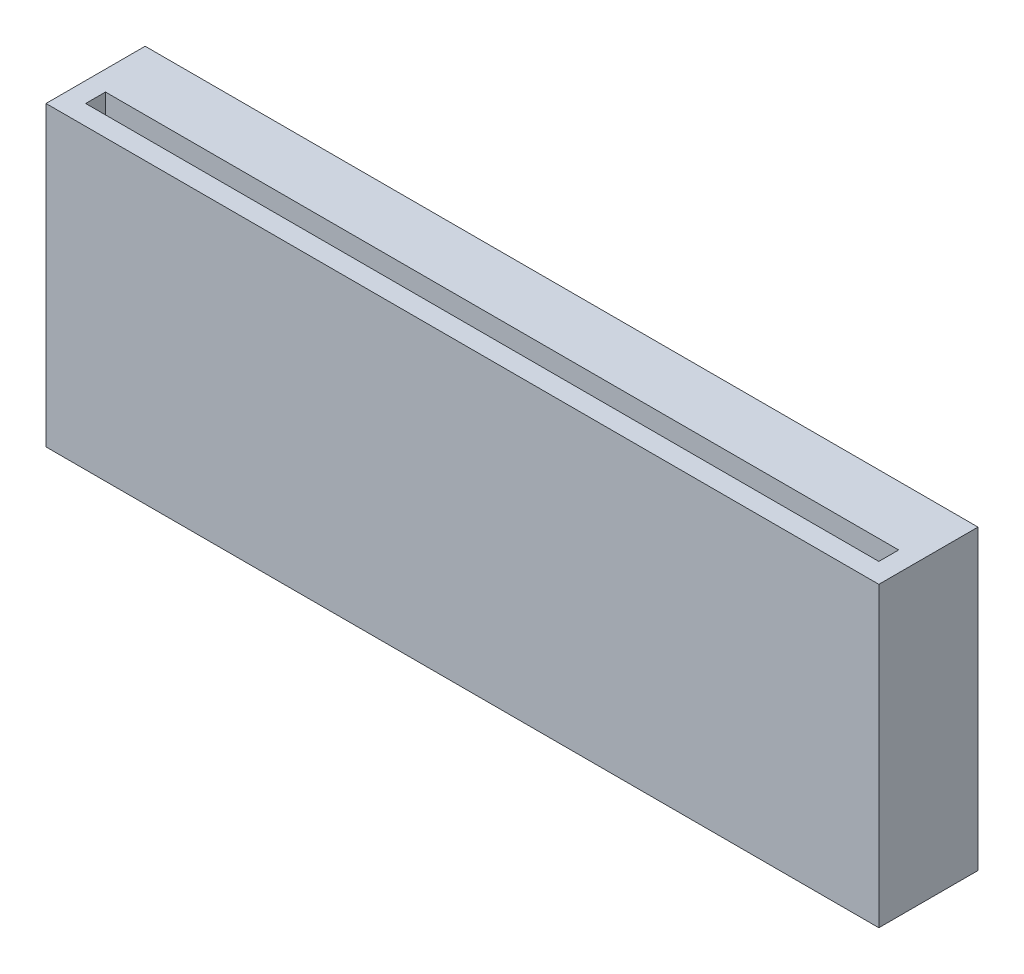
ISO-10303-21;
HEADER;
FILE_DESCRIPTION(('STEP AP214'),'2;1');
FILE_NAME('part.step','',(''),(''),'','','');
FILE_SCHEMA(('AUTOMOTIVE_DESIGN { 1 0 10303 214 1 1 1 1 }'));
ENDSEC;
DATA;
#1=APPLICATION_CONTEXT('core data for automotive mechanical design processes');
#2=APPLICATION_PROTOCOL_DEFINITION('international standard','automotive_design',2000,#1);
#3=PRODUCT_CONTEXT('',#1,'mechanical');
#4=PRODUCT('Part','Part','',(#3));
#5=PRODUCT_RELATED_PRODUCT_CATEGORY('part','',(#4));
#6=PRODUCT_DEFINITION_FORMATION('','',#4);
#7=PRODUCT_DEFINITION_CONTEXT('part definition',#1,'design');
#8=PRODUCT_DEFINITION('design','',#6,#7);
#9=PRODUCT_DEFINITION_SHAPE('','',#8);
#10=(LENGTH_UNIT() NAMED_UNIT(*) SI_UNIT(.MILLI.,.METRE.));
#11=(NAMED_UNIT(*) PLANE_ANGLE_UNIT() SI_UNIT($,.RADIAN.));
#12=(NAMED_UNIT(*) SI_UNIT($,.STERADIAN.) SOLID_ANGLE_UNIT());
#13=UNCERTAINTY_MEASURE_WITH_UNIT(LENGTH_MEASURE(1.E-05),#10,'distance_accuracy_value','');
#14=(GEOMETRIC_REPRESENTATION_CONTEXT(3) GLOBAL_UNCERTAINTY_ASSIGNED_CONTEXT((#13)) GLOBAL_UNIT_ASSIGNED_CONTEXT((#10,
#11,#12)) REPRESENTATION_CONTEXT('',''));
#15=CARTESIAN_POINT('',(0.,0.,0.));
#16=DIRECTION('',(0.,0.,1.));
#17=DIRECTION('',(1.,0.,0.));
#18=AXIS2_PLACEMENT_3D('',#15,#16,#17);
#19=CARTESIAN_POINT('',(0.,0.,0.));
#20=DIRECTION('',(0.,0.,1.));
#21=DIRECTION('',(1.,0.,0.));
#22=AXIS2_PLACEMENT_3D('',#19,#20,#21);
#23=PLANE('',#22);
#24=DIRECTION('',(0.,-1.,0.));
#25=VECTOR('',#24,1.);
#26=CARTESIAN_POINT('',(-32.,7.5,0.));
#27=LINE('',#26,#25);
#28=CARTESIAN_POINT('',(-32.,7.5,0.));
#29=VERTEX_POINT('',#28);
#30=CARTESIAN_POINT('',(-32.,0.,0.));
#31=VERTEX_POINT('',#30);
#32=EDGE_CURVE('E365',#29,#31,#27,.T.);
#33=ORIENTED_EDGE('',*,*,#32,.T.);
#34=DIRECTION('',(1.,0.,0.));
#35=VECTOR('',#34,1.);
#36=CARTESIAN_POINT('',(0.,0.,0.));
#37=LINE('',#36,#35);
#38=CARTESIAN_POINT('',(-41.,0.,0.));
#39=VERTEX_POINT('',#38);
#40=EDGE_CURVE('E43',#39,#31,#37,.T.);
#41=ORIENTED_EDGE('',*,*,#40,.F.);
#42=DIRECTION('',(0.,1.,0.));
#43=VECTOR('',#42,1.);
#44=CARTESIAN_POINT('',(-41.,0.,0.));
#45=LINE('',#44,#43);
#46=CARTESIAN_POINT('',(-41.,15.,0.));
#47=VERTEX_POINT('',#46);
#48=EDGE_CURVE('E271',#39,#47,#45,.T.);
#49=ORIENTED_EDGE('',*,*,#48,.T.);
#50=DIRECTION('',(-1.,0.,0.));
#51=VECTOR('',#50,1.);
#52=CARTESIAN_POINT('',(0.,15.,0.));
#53=LINE('',#52,#51);
#54=CARTESIAN_POINT('',(1.,15.,0.));
#55=VERTEX_POINT('',#54);
#56=EDGE_CURVE('E483',#55,#47,#53,.T.);
#57=ORIENTED_EDGE('',*,*,#56,.F.);
#58=DIRECTION('',(0.,1.,0.));
#59=VECTOR('',#58,1.);
#60=CARTESIAN_POINT('',(1.,0.,0.));
#61=LINE('',#60,#59);
#62=CARTESIAN_POINT('',(1.,0.,0.));
#63=VERTEX_POINT('',#62);
#64=EDGE_CURVE('E292',#63,#55,#61,.T.);
#65=ORIENTED_EDGE('',*,*,#64,.F.);
#66=CARTESIAN_POINT('',(-8.,0.,0.));
#67=VERTEX_POINT('',#66);
#68=EDGE_CURVE('E513',#67,#63,#37,.T.);
#69=ORIENTED_EDGE('',*,*,#68,.F.);
#70=DIRECTION('',(0.,-1.,0.));
#71=VECTOR('',#70,1.);
#72=CARTESIAN_POINT('',(-8.,7.5,0.));
#73=LINE('',#72,#71);
#74=CARTESIAN_POINT('',(-8.,7.5,0.));
#75=VERTEX_POINT('',#74);
#76=EDGE_CURVE('E445',#75,#67,#73,.T.);
#77=ORIENTED_EDGE('',*,*,#76,.F.);
#78=DIRECTION('',(-1.,0.,0.));
#79=VECTOR('',#78,1.);
#80=CARTESIAN_POINT('',(-8.,7.5,0.));
#81=LINE('',#80,#79);
#82=CARTESIAN_POINT('',(-12.,7.5,0.));
#83=VERTEX_POINT('',#82);
#84=EDGE_CURVE('E408',#75,#83,#81,.T.);
#85=ORIENTED_EDGE('',*,*,#84,.T.);
#86=DIRECTION('',(0.,-1.,0.));
#87=VECTOR('',#86,1.);
#88=CARTESIAN_POINT('',(-12.,7.5,0.));
#89=LINE('',#88,#87);
#90=CARTESIAN_POINT('',(-12.,0.,0.));
#91=VERTEX_POINT('',#90);
#92=EDGE_CURVE('E505',#83,#91,#89,.T.);
#93=ORIENTED_EDGE('',*,*,#92,.T.);
#94=CARTESIAN_POINT('',(-28.,0.,0.));
#95=VERTEX_POINT('',#94);
#96=EDGE_CURVE('E517',#95,#91,#37,.T.);
#97=ORIENTED_EDGE('',*,*,#96,.F.);
#98=DIRECTION('',(0.,-1.,0.));
#99=VECTOR('',#98,1.);
#100=CARTESIAN_POINT('',(-28.,7.5,0.));
#101=LINE('',#100,#99);
#102=CARTESIAN_POINT('',(-28.,7.5,0.));
#103=VERTEX_POINT('',#102);
#104=EDGE_CURVE('E370',#103,#95,#101,.T.);
#105=ORIENTED_EDGE('',*,*,#104,.F.);
#106=DIRECTION('',(1.,0.,0.));
#107=VECTOR('',#106,1.);
#108=CARTESIAN_POINT('',(-32.,7.5,0.));
#109=LINE('',#108,#107);
#110=EDGE_CURVE('E336',#29,#103,#109,.T.);
#111=ORIENTED_EDGE('',*,*,#110,.F.);
#112=EDGE_LOOP('',(#33,#41,#49,#57,#65,#69,#77,#85,#93,#97,#105,#111));
#113=FACE_BOUND('',#112,.T.);
#114=ADVANCED_FACE('F39',(#113),#23,.F.);
#115=CARTESIAN_POINT('',(0.,15.,5.));
#116=DIRECTION('',(0.,-1.,0.));
#117=DIRECTION('',(1.,0.,0.));
#118=AXIS2_PLACEMENT_3D('',#115,#116,#117);
#119=PLANE('',#118);
#120=DIRECTION('',(-1.,0.,0.));
#121=VECTOR('',#120,1.);
#122=CARTESIAN_POINT('',(0.,15.,3.));
#123=LINE('',#122,#121);
#124=CARTESIAN_POINT('',(0.,15.,3.));
#125=VERTEX_POINT('',#124);
#126=CARTESIAN_POINT('',(-40.,15.,3.00000000000001));
#127=VERTEX_POINT('',#126);
#128=EDGE_CURVE('E262',#125,#127,#123,.T.);
#129=ORIENTED_EDGE('',*,*,#128,.F.);
#130=DIRECTION('',(0.,0.,-1.));
#131=VECTOR('',#130,1.);
#132=CARTESIAN_POINT('',(0.,15.,3.));
#133=LINE('',#132,#131);
#134=CARTESIAN_POINT('',(0.,15.,4.));
#135=VERTEX_POINT('',#134);
#136=EDGE_CURVE('E57',#135,#125,#133,.T.);
#137=ORIENTED_EDGE('',*,*,#136,.F.);
#138=DIRECTION('',(1.,0.,0.));
#139=VECTOR('',#138,1.);
#140=CARTESIAN_POINT('',(0.,15.,4.));
#141=LINE('',#140,#139);
#142=CARTESIAN_POINT('',(-40.,15.,4.00000000000001));
#143=VERTEX_POINT('',#142);
#144=EDGE_CURVE('E249',#143,#135,#141,.T.);
#145=ORIENTED_EDGE('',*,*,#144,.F.);
#146=DIRECTION('',(0.,0.,1.));
#147=VECTOR('',#146,1.);
#148=CARTESIAN_POINT('',(-40.,15.,3.00000000000001));
#149=LINE('',#148,#147);
#150=EDGE_CURVE('E253',#127,#143,#149,.T.);
#151=ORIENTED_EDGE('',*,*,#150,.F.);
#152=EDGE_LOOP('',(#129,#137,#145,#151));
#153=FACE_BOUND('',#152,.T.);
#154=ORIENTED_EDGE('',*,*,#56,.T.);
#155=DIRECTION('',(0.,0.,1.));
#156=VECTOR('',#155,1.);
#157=CARTESIAN_POINT('',(-41.,15.,0.));
#158=LINE('',#157,#156);
#159=CARTESIAN_POINT('',(-41.,15.,5.));
#160=VERTEX_POINT('',#159);
#161=EDGE_CURVE('E288',#47,#160,#158,.T.);
#162=ORIENTED_EDGE('',*,*,#161,.T.);
#163=DIRECTION('',(-1.,0.,0.));
#164=VECTOR('',#163,1.);
#165=CARTESIAN_POINT('',(0.,15.,5.));
#166=LINE('',#165,#164);
#167=CARTESIAN_POINT('',(1.,15.,5.));
#168=VERTEX_POINT('',#167);
#169=EDGE_CURVE('E49',#168,#160,#166,.T.);
#170=ORIENTED_EDGE('',*,*,#169,.F.);
#171=DIRECTION('',(0.,0.,1.));
#172=VECTOR('',#171,1.);
#173=CARTESIAN_POINT('',(1.,15.,0.));
#174=LINE('',#173,#172);
#175=EDGE_CURVE('E296',#55,#168,#174,.T.);
#176=ORIENTED_EDGE('',*,*,#175,.F.);
#177=EDGE_LOOP('',(#154,#162,#170,#176));
#178=FACE_BOUND('',#177,.T.);
#179=ADVANCED_FACE('F41',(#153,#178),#119,.F.);
#180=CARTESIAN_POINT('',(0.,0.,5.));
#181=DIRECTION('',(0.,1.,0.));
#182=DIRECTION('',(0.,0.,1.));
#183=AXIS2_PLACEMENT_3D('',#180,#181,#182);
#184=PLANE('',#183);
#185=ORIENTED_EDGE('',*,*,#40,.T.);
#186=DIRECTION('',(0.,0.,1.));
#187=VECTOR('',#186,1.);
#188=CARTESIAN_POINT('',(-32.,0.,0.));
#189=LINE('',#188,#187);
#190=CARTESIAN_POINT('',(-32.,0.,-2.49999999999999));
#191=VERTEX_POINT('',#190);
#192=EDGE_CURVE('E308',#191,#31,#189,.T.);
#193=ORIENTED_EDGE('',*,*,#192,.F.);
#194=DIRECTION('',(1.,0.,0.));
#195=VECTOR('',#194,1.);
#196=CARTESIAN_POINT('',(-32.,0.,-2.49999999999999));
#197=LINE('',#196,#195);
#198=CARTESIAN_POINT('',(-34.5,0.,-2.5));
#199=VERTEX_POINT('',#198);
#200=EDGE_CURVE('E342',#199,#191,#197,.T.);
#201=ORIENTED_EDGE('',*,*,#200,.F.);
#202=DIRECTION('',(0.,0.,1.));
#203=VECTOR('',#202,1.);
#204=CARTESIAN_POINT('',(-34.5,0.,-2.5));
#205=LINE('',#204,#203);
#206=CARTESIAN_POINT('',(-34.5,0.,-3.5));
#207=VERTEX_POINT('',#206);
#208=EDGE_CURVE('E345',#207,#199,#205,.T.);
#209=ORIENTED_EDGE('',*,*,#208,.F.);
#210=DIRECTION('',(-0.707106781186547,0.,0.707106781186548));
#211=VECTOR('',#210,1.);
#212=CARTESIAN_POINT('',(-34.5,0.,-3.5));
#213=LINE('',#212,#211);
#214=CARTESIAN_POINT('',(-32.,0.,-6.));
#215=VERTEX_POINT('',#214);
#216=EDGE_CURVE('E348',#215,#207,#213,.T.);
#217=ORIENTED_EDGE('',*,*,#216,.F.);
#218=DIRECTION('',(-1.,0.,0.));
#219=VECTOR('',#218,1.);
#220=CARTESIAN_POINT('',(-32.,0.,-6.));
#221=LINE('',#220,#219);
#222=CARTESIAN_POINT('',(-28.,0.,-6.));
#223=VERTEX_POINT('',#222);
#224=EDGE_CURVE('E351',#223,#215,#221,.T.);
#225=ORIENTED_EDGE('',*,*,#224,.F.);
#226=DIRECTION('',(-0.707106781186548,0.,-0.707106781186547));
#227=VECTOR('',#226,1.);
#228=CARTESIAN_POINT('',(-28.,0.,-6.));
#229=LINE('',#228,#227);
#230=CARTESIAN_POINT('',(-25.5,0.,-3.5));
#231=VERTEX_POINT('',#230);
#232=EDGE_CURVE('E354',#231,#223,#229,.T.);
#233=ORIENTED_EDGE('',*,*,#232,.F.);
#234=DIRECTION('',(0.,0.,-1.));
#235=VECTOR('',#234,1.);
#236=CARTESIAN_POINT('',(-25.5,0.,-3.5));
#237=LINE('',#236,#235);
#238=CARTESIAN_POINT('',(-25.5,0.,-2.5));
#239=VERTEX_POINT('',#238);
#240=EDGE_CURVE('E357',#239,#231,#237,.T.);
#241=ORIENTED_EDGE('',*,*,#240,.F.);
#242=DIRECTION('',(1.,0.,0.));
#243=VECTOR('',#242,1.);
#244=CARTESIAN_POINT('',(-25.5,0.,-2.5));
#245=LINE('',#244,#243);
#246=CARTESIAN_POINT('',(-28.,0.,-2.49999999999999));
#247=VERTEX_POINT('',#246);
#248=EDGE_CURVE('E360',#247,#239,#245,.T.);
#249=ORIENTED_EDGE('',*,*,#248,.F.);
#250=DIRECTION('',(0.,0.,-1.));
#251=VECTOR('',#250,1.);
#252=CARTESIAN_POINT('',(-28.,0.,0.));
#253=LINE('',#252,#251);
#254=EDGE_CURVE('E65',#95,#247,#253,.T.);
#255=ORIENTED_EDGE('',*,*,#254,.F.);
#256=ORIENTED_EDGE('',*,*,#96,.T.);
#257=DIRECTION('',(0.,0.,-1.));
#258=VECTOR('',#257,1.);
#259=CARTESIAN_POINT('',(-12.,0.,0.));
#260=LINE('',#259,#258);
#261=CARTESIAN_POINT('',(-12.,0.,-2.49999999999999));
#262=VERTEX_POINT('',#261);
#263=EDGE_CURVE('E449',#91,#262,#260,.T.);
#264=ORIENTED_EDGE('',*,*,#263,.T.);
#265=DIRECTION('',(-1.,0.,0.));
#266=VECTOR('',#265,1.);
#267=CARTESIAN_POINT('',(-14.5,0.,-2.5));
#268=LINE('',#267,#266);
#269=CARTESIAN_POINT('',(-14.5,0.,-2.5));
#270=VERTEX_POINT('',#269);
#271=EDGE_CURVE('E453',#262,#270,#268,.T.);
#272=ORIENTED_EDGE('',*,*,#271,.T.);
#273=DIRECTION('',(0.,0.,-1.));
#274=VECTOR('',#273,1.);
#275=CARTESIAN_POINT('',(-14.5,0.,-3.5));
#276=LINE('',#275,#274);
#277=CARTESIAN_POINT('',(-14.5,0.,-3.5));
#278=VERTEX_POINT('',#277);
#279=EDGE_CURVE('E457',#270,#278,#276,.T.);
#280=ORIENTED_EDGE('',*,*,#279,.T.);
#281=DIRECTION('',(0.707106781186548,0.,-0.707106781186547));
#282=VECTOR('',#281,1.);
#283=CARTESIAN_POINT('',(-12.,0.,-6.));
#284=LINE('',#283,#282);
#285=CARTESIAN_POINT('',(-12.,0.,-6.));
#286=VERTEX_POINT('',#285);
#287=EDGE_CURVE('E461',#278,#286,#284,.T.);
#288=ORIENTED_EDGE('',*,*,#287,.T.);
#289=DIRECTION('',(1.,0.,0.));
#290=VECTOR('',#289,1.);
#291=CARTESIAN_POINT('',(-8.,0.,-6.));
#292=LINE('',#291,#290);
#293=CARTESIAN_POINT('',(-8.,0.,-6.));
#294=VERTEX_POINT('',#293);
#295=EDGE_CURVE('E465',#286,#294,#292,.T.);
#296=ORIENTED_EDGE('',*,*,#295,.T.);
#297=DIRECTION('',(0.707106781186547,0.,0.707106781186548));
#298=VECTOR('',#297,1.);
#299=CARTESIAN_POINT('',(-5.5,0.,-3.5));
#300=LINE('',#299,#298);
#301=CARTESIAN_POINT('',(-5.5,0.,-3.5));
#302=VERTEX_POINT('',#301);
#303=EDGE_CURVE('E469',#294,#302,#300,.T.);
#304=ORIENTED_EDGE('',*,*,#303,.T.);
#305=DIRECTION('',(0.,0.,1.));
#306=VECTOR('',#305,1.);
#307=CARTESIAN_POINT('',(-5.5,0.,-2.5));
#308=LINE('',#307,#306);
#309=CARTESIAN_POINT('',(-5.5,0.,-2.5));
#310=VERTEX_POINT('',#309);
#311=EDGE_CURVE('E473',#302,#310,#308,.T.);
#312=ORIENTED_EDGE('',*,*,#311,.T.);
#313=DIRECTION('',(-1.,0.,0.));
#314=VECTOR('',#313,1.);
#315=CARTESIAN_POINT('',(-8.,0.,-2.49999999999999));
#316=LINE('',#315,#314);
#317=CARTESIAN_POINT('',(-8.,0.,-2.49999999999999));
#318=VERTEX_POINT('',#317);
#319=EDGE_CURVE('E409',#310,#318,#316,.T.);
#320=ORIENTED_EDGE('',*,*,#319,.T.);
#321=DIRECTION('',(0.,0.,1.));
#322=VECTOR('',#321,1.);
#323=CARTESIAN_POINT('',(-8.,0.,0.));
#324=LINE('',#323,#322);
#325=EDGE_CURVE('E369',#318,#67,#324,.T.);
#326=ORIENTED_EDGE('',*,*,#325,.T.);
#327=ORIENTED_EDGE('',*,*,#68,.T.);
#328=DIRECTION('',(0.,0.,-1.));
#329=VECTOR('',#328,1.);
#330=CARTESIAN_POINT('',(1.,0.,0.));
#331=LINE('',#330,#329);
#332=CARTESIAN_POINT('',(1.,0.,5.));
#333=VERTEX_POINT('',#332);
#334=EDGE_CURVE('E304',#333,#63,#331,.T.);
#335=ORIENTED_EDGE('',*,*,#334,.F.);
#336=DIRECTION('',(1.,0.,0.));
#337=VECTOR('',#336,1.);
#338=CARTESIAN_POINT('',(0.,0.,5.));
#339=LINE('',#338,#337);
#340=CARTESIAN_POINT('',(-41.,0.,5.));
#341=VERTEX_POINT('',#340);
#342=EDGE_CURVE('E11',#341,#333,#339,.T.);
#343=ORIENTED_EDGE('',*,*,#342,.F.);
#344=DIRECTION('',(0.,0.,-1.));
#345=VECTOR('',#344,1.);
#346=CARTESIAN_POINT('',(-41.,0.,0.));
#347=LINE('',#346,#345);
#348=EDGE_CURVE('E280',#341,#39,#347,.T.);
#349=ORIENTED_EDGE('',*,*,#348,.T.);
#350=EDGE_LOOP('',(#185,#193,#201,#209,#217,#225,#233,#241,#249,#255,#256,#264,#272,#280,#288,
#296,#304,#312,#320,#326,#327,#335,#343,#349));
#351=FACE_BOUND('',#350,.T.);
#352=ADVANCED_FACE('F524',(#351),#184,.F.);
#353=CARTESIAN_POINT('',(0.,0.,5.));
#354=DIRECTION('',(0.,0.,1.));
#355=DIRECTION('',(1.,0.,0.));
#356=AXIS2_PLACEMENT_3D('',#353,#354,#355);
#357=PLANE('',#356);
#358=ORIENTED_EDGE('',*,*,#342,.T.);
#359=DIRECTION('',(0.,-1.,0.));
#360=VECTOR('',#359,1.);
#361=CARTESIAN_POINT('',(1.,0.,5.));
#362=LINE('',#361,#360);
#363=EDGE_CURVE('E300',#168,#333,#362,.T.);
#364=ORIENTED_EDGE('',*,*,#363,.F.);
#365=ORIENTED_EDGE('',*,*,#169,.T.);
#366=DIRECTION('',(0.,-1.,0.));
#367=VECTOR('',#366,1.);
#368=CARTESIAN_POINT('',(-41.,0.,5.));
#369=LINE('',#368,#367);
#370=EDGE_CURVE('E284',#160,#341,#369,.T.);
#371=ORIENTED_EDGE('',*,*,#370,.T.);
#372=EDGE_LOOP('',(#358,#364,#365,#371));
#373=FACE_BOUND('',#372,.T.);
#374=ADVANCED_FACE('F540',(#373),#357,.T.);
#375=CARTESIAN_POINT('',(-8.,7.5,0.));
#376=DIRECTION('',(1.,0.,0.));
#377=DIRECTION('',(0.,0.,-1.));
#378=AXIS2_PLACEMENT_3D('',#375,#376,#377);
#379=PLANE('',#378);
#380=ORIENTED_EDGE('',*,*,#325,.F.);
#381=DIRECTION('',(0.,-1.,0.));
#382=VECTOR('',#381,1.);
#383=CARTESIAN_POINT('',(-8.,7.5,-2.49999999999999));
#384=LINE('',#383,#382);
#385=CARTESIAN_POINT('',(-8.,7.5,-2.49999999999999));
#386=VERTEX_POINT('',#385);
#387=EDGE_CURVE('E480',#386,#318,#384,.T.);
#388=ORIENTED_EDGE('',*,*,#387,.F.);
#389=DIRECTION('',(0.,0.,1.));
#390=VECTOR('',#389,1.);
#391=CARTESIAN_POINT('',(-8.,7.5,0.));
#392=LINE('',#391,#390);
#393=EDGE_CURVE('E404',#386,#75,#392,.T.);
#394=ORIENTED_EDGE('',*,*,#393,.T.);
#395=ORIENTED_EDGE('',*,*,#76,.T.);
#396=EDGE_LOOP('',(#380,#388,#394,#395));
#397=FACE_BOUND('',#396,.T.);
#398=ADVANCED_FACE('F544',(#397),#379,.T.);
#399=CARTESIAN_POINT('',(-8.,7.5,-2.49999999999999));
#400=DIRECTION('',(0.,0.,1.));
#401=DIRECTION('',(1.,0.,0.));
#402=AXIS2_PLACEMENT_3D('',#399,#400,#401);
#403=PLANE('',#402);
#404=ORIENTED_EDGE('',*,*,#319,.F.);
#405=DIRECTION('',(0.,-1.,0.));
#406=VECTOR('',#405,1.);
#407=CARTESIAN_POINT('',(-5.5,7.5,-2.5));
#408=LINE('',#407,#406);
#409=CARTESIAN_POINT('',(-5.5,7.5,-2.5));
#410=VERTEX_POINT('',#409);
#411=EDGE_CURVE('E484',#410,#310,#408,.T.);
#412=ORIENTED_EDGE('',*,*,#411,.F.);
#413=DIRECTION('',(-1.,0.,0.));
#414=VECTOR('',#413,1.);
#415=CARTESIAN_POINT('',(-8.,7.5,-2.49999999999999));
#416=LINE('',#415,#414);
#417=EDGE_CURVE('E441',#410,#386,#416,.T.);
#418=ORIENTED_EDGE('',*,*,#417,.T.);
#419=ORIENTED_EDGE('',*,*,#387,.T.);
#420=EDGE_LOOP('',(#404,#412,#418,#419));
#421=FACE_BOUND('',#420,.T.);
#422=ADVANCED_FACE('F549',(#421),#403,.T.);
#423=CARTESIAN_POINT('',(-5.5,7.5,-2.5));
#424=DIRECTION('',(1.,0.,0.));
#425=DIRECTION('',(0.,0.,-1.));
#426=AXIS2_PLACEMENT_3D('',#423,#424,#425);
#427=PLANE('',#426);
#428=ORIENTED_EDGE('',*,*,#311,.F.);
#429=DIRECTION('',(0.,-1.,0.));
#430=VECTOR('',#429,1.);
#431=CARTESIAN_POINT('',(-5.5,7.5,-3.5));
#432=LINE('',#431,#430);
#433=CARTESIAN_POINT('',(-5.5,7.5,-3.5));
#434=VERTEX_POINT('',#433);
#435=EDGE_CURVE('E487',#434,#302,#432,.T.);
#436=ORIENTED_EDGE('',*,*,#435,.F.);
#437=DIRECTION('',(0.,0.,1.));
#438=VECTOR('',#437,1.);
#439=CARTESIAN_POINT('',(-5.5,7.5,-2.5));
#440=LINE('',#439,#438);
#441=EDGE_CURVE('E437',#434,#410,#440,.T.);
#442=ORIENTED_EDGE('',*,*,#441,.T.);
#443=ORIENTED_EDGE('',*,*,#411,.T.);
#444=EDGE_LOOP('',(#428,#436,#442,#443));
#445=FACE_BOUND('',#444,.T.);
#446=ADVANCED_FACE('F581',(#445),#427,.T.);
#447=CARTESIAN_POINT('',(-5.5,7.5,-3.5));
#448=DIRECTION('',(0.707106781186548,0.,-0.707106781186547));
#449=DIRECTION('',(-0.707106781186547,0.,-0.707106781186548));
#450=AXIS2_PLACEMENT_3D('',#447,#448,#449);
#451=PLANE('',#450);
#452=ORIENTED_EDGE('',*,*,#303,.F.);
#453=DIRECTION('',(0.,-1.,0.));
#454=VECTOR('',#453,1.);
#455=CARTESIAN_POINT('',(-8.,7.5,-6.));
#456=LINE('',#455,#454);
#457=CARTESIAN_POINT('',(-8.,7.5,-6.));
#458=VERTEX_POINT('',#457);
#459=EDGE_CURVE('E490',#458,#294,#456,.T.);
#460=ORIENTED_EDGE('',*,*,#459,.F.);
#461=DIRECTION('',(0.707106781186547,0.,0.707106781186548));
#462=VECTOR('',#461,1.);
#463=CARTESIAN_POINT('',(-5.5,7.5,-3.5));
#464=LINE('',#463,#462);
#465=EDGE_CURVE('E433',#458,#434,#464,.T.);
#466=ORIENTED_EDGE('',*,*,#465,.T.);
#467=ORIENTED_EDGE('',*,*,#435,.T.);
#468=EDGE_LOOP('',(#452,#460,#466,#467));
#469=FACE_BOUND('',#468,.T.);
#470=ADVANCED_FACE('F579',(#469),#451,.T.);
#471=CARTESIAN_POINT('',(-8.,7.5,-6.));
#472=DIRECTION('',(0.,0.,-1.));
#473=DIRECTION('',(-1.,0.,0.));
#474=AXIS2_PLACEMENT_3D('',#471,#472,#473);
#475=PLANE('',#474);
#476=ORIENTED_EDGE('',*,*,#295,.F.);
#477=DIRECTION('',(0.,-1.,0.));
#478=VECTOR('',#477,1.);
#479=CARTESIAN_POINT('',(-12.,7.5,-6.));
#480=LINE('',#479,#478);
#481=CARTESIAN_POINT('',(-12.,7.5,-6.));
#482=VERTEX_POINT('',#481);
#483=EDGE_CURVE('E493',#482,#286,#480,.T.);
#484=ORIENTED_EDGE('',*,*,#483,.F.);
#485=DIRECTION('',(1.,0.,0.));
#486=VECTOR('',#485,1.);
#487=CARTESIAN_POINT('',(-8.,7.5,-6.));
#488=LINE('',#487,#486);
#489=EDGE_CURVE('E429',#482,#458,#488,.T.);
#490=ORIENTED_EDGE('',*,*,#489,.T.);
#491=ORIENTED_EDGE('',*,*,#459,.T.);
#492=EDGE_LOOP('',(#476,#484,#490,#491));
#493=FACE_BOUND('',#492,.T.);
#494=ADVANCED_FACE('F575',(#493),#475,.T.);
#495=CARTESIAN_POINT('',(-12.,7.5,-6.));
#496=DIRECTION('',(-0.707106781186547,0.,-0.707106781186548));
#497=DIRECTION('',(-0.707106781186548,0.,0.707106781186547));
#498=AXIS2_PLACEMENT_3D('',#495,#496,#497);
#499=PLANE('',#498);
#500=ORIENTED_EDGE('',*,*,#287,.F.);
#501=DIRECTION('',(0.,-1.,0.));
#502=VECTOR('',#501,1.);
#503=CARTESIAN_POINT('',(-14.5,7.5,-3.5));
#504=LINE('',#503,#502);
#505=CARTESIAN_POINT('',(-14.5,7.5,-3.5));
#506=VERTEX_POINT('',#505);
#507=EDGE_CURVE('E496',#506,#278,#504,.T.);
#508=ORIENTED_EDGE('',*,*,#507,.F.);
#509=DIRECTION('',(0.707106781186548,0.,-0.707106781186547));
#510=VECTOR('',#509,1.);
#511=CARTESIAN_POINT('',(-12.,7.5,-6.));
#512=LINE('',#511,#510);
#513=EDGE_CURVE('E425',#506,#482,#512,.T.);
#514=ORIENTED_EDGE('',*,*,#513,.T.);
#515=ORIENTED_EDGE('',*,*,#483,.T.);
#516=EDGE_LOOP('',(#500,#508,#514,#515));
#517=FACE_BOUND('',#516,.T.);
#518=ADVANCED_FACE('F571',(#517),#499,.T.);
#519=CARTESIAN_POINT('',(-14.5,7.5,-3.5));
#520=DIRECTION('',(-1.,0.,0.));
#521=DIRECTION('',(0.,0.,1.));
#522=AXIS2_PLACEMENT_3D('',#519,#520,#521);
#523=PLANE('',#522);
#524=ORIENTED_EDGE('',*,*,#279,.F.);
#525=DIRECTION('',(0.,-1.,0.));
#526=VECTOR('',#525,1.);
#527=CARTESIAN_POINT('',(-14.5,7.5,-2.5));
#528=LINE('',#527,#526);
#529=CARTESIAN_POINT('',(-14.5,7.5,-2.5));
#530=VERTEX_POINT('',#529);
#531=EDGE_CURVE('E499',#530,#270,#528,.T.);
#532=ORIENTED_EDGE('',*,*,#531,.F.);
#533=DIRECTION('',(0.,0.,-1.));
#534=VECTOR('',#533,1.);
#535=CARTESIAN_POINT('',(-14.5,7.5,-3.5));
#536=LINE('',#535,#534);
#537=EDGE_CURVE('E421',#530,#506,#536,.T.);
#538=ORIENTED_EDGE('',*,*,#537,.T.);
#539=ORIENTED_EDGE('',*,*,#507,.T.);
#540=EDGE_LOOP('',(#524,#532,#538,#539));
#541=FACE_BOUND('',#540,.T.);
#542=ADVANCED_FACE('F567',(#541),#523,.T.);
#543=CARTESIAN_POINT('',(-14.5,7.5,-2.5));
#544=DIRECTION('',(0.,0.,1.));
#545=DIRECTION('',(1.,0.,0.));
#546=AXIS2_PLACEMENT_3D('',#543,#544,#545);
#547=PLANE('',#546);
#548=ORIENTED_EDGE('',*,*,#271,.F.);
#549=DIRECTION('',(0.,-1.,0.));
#550=VECTOR('',#549,1.);
#551=CARTESIAN_POINT('',(-12.,7.5,-2.49999999999999));
#552=LINE('',#551,#550);
#553=CARTESIAN_POINT('',(-12.,7.5,-2.49999999999999));
#554=VERTEX_POINT('',#553);
#555=EDGE_CURVE('E502',#554,#262,#552,.T.);
#556=ORIENTED_EDGE('',*,*,#555,.F.);
#557=DIRECTION('',(-1.,0.,0.));
#558=VECTOR('',#557,1.);
#559=CARTESIAN_POINT('',(-14.5,7.5,-2.5));
#560=LINE('',#559,#558);
#561=EDGE_CURVE('E417',#554,#530,#560,.T.);
#562=ORIENTED_EDGE('',*,*,#561,.T.);
#563=ORIENTED_EDGE('',*,*,#531,.T.);
#564=EDGE_LOOP('',(#548,#556,#562,#563));
#565=FACE_BOUND('',#564,.T.);
#566=ADVANCED_FACE('F565',(#565),#547,.T.);
#567=CARTESIAN_POINT('',(-12.,7.5,0.));
#568=DIRECTION('',(-1.,0.,0.));
#569=DIRECTION('',(0.,0.,1.));
#570=AXIS2_PLACEMENT_3D('',#567,#568,#569);
#571=PLANE('',#570);
#572=ORIENTED_EDGE('',*,*,#263,.F.);
#573=ORIENTED_EDGE('',*,*,#92,.F.);
#574=DIRECTION('',(0.,0.,-1.));
#575=VECTOR('',#574,1.);
#576=CARTESIAN_POINT('',(-12.,7.5,0.));
#577=LINE('',#576,#575);
#578=EDGE_CURVE('E413',#83,#554,#577,.T.);
#579=ORIENTED_EDGE('',*,*,#578,.T.);
#580=ORIENTED_EDGE('',*,*,#555,.T.);
#581=EDGE_LOOP('',(#572,#573,#579,#580));
#582=FACE_BOUND('',#581,.T.);
#583=ADVANCED_FACE('F559',(#582),#571,.T.);
#584=CARTESIAN_POINT('',(0.,7.5,0.));
#585=DIRECTION('',(0.,-1.,0.));
#586=DIRECTION('',(0.,0.,-1.));
#587=AXIS2_PLACEMENT_3D('',#584,#585,#586);
#588=PLANE('',#587);
#589=ORIENTED_EDGE('',*,*,#393,.F.);
#590=ORIENTED_EDGE('',*,*,#417,.F.);
#591=ORIENTED_EDGE('',*,*,#441,.F.);
#592=ORIENTED_EDGE('',*,*,#465,.F.);
#593=ORIENTED_EDGE('',*,*,#489,.F.);
#594=ORIENTED_EDGE('',*,*,#513,.F.);
#595=ORIENTED_EDGE('',*,*,#537,.F.);
#596=ORIENTED_EDGE('',*,*,#561,.F.);
#597=ORIENTED_EDGE('',*,*,#578,.F.);
#598=ORIENTED_EDGE('',*,*,#84,.F.);
#599=EDGE_LOOP('',(#589,#590,#591,#592,#593,#594,#595,#596,#597,#598));
#600=FACE_BOUND('',#599,.T.);
#601=ADVANCED_FACE('F552',(#600),#588,.F.);
#602=CARTESIAN_POINT('',(-32.,7.5,0.));
#603=DIRECTION('',(1.,0.,0.));
#604=DIRECTION('',(0.,0.,-1.));
#605=AXIS2_PLACEMENT_3D('',#602,#603,#604);
#606=PLANE('',#605);
#607=ORIENTED_EDGE('',*,*,#192,.T.);
#608=ORIENTED_EDGE('',*,*,#32,.F.);
#609=DIRECTION('',(0.,0.,1.));
#610=VECTOR('',#609,1.);
#611=CARTESIAN_POINT('',(-32.,7.5,0.));
#612=LINE('',#611,#610);
#613=CARTESIAN_POINT('',(-32.,7.5,-2.49999999999999));
#614=VERTEX_POINT('',#613);
#615=EDGE_CURVE('E309',#614,#29,#612,.T.);
#616=ORIENTED_EDGE('',*,*,#615,.F.);
#617=DIRECTION('',(0.,-1.,0.));
#618=VECTOR('',#617,1.);
#619=CARTESIAN_POINT('',(-32.,7.5,-2.49999999999999));
#620=LINE('',#619,#618);
#621=EDGE_CURVE('E339',#614,#191,#620,.T.);
#622=ORIENTED_EDGE('',*,*,#621,.T.);
#623=EDGE_LOOP('',(#607,#608,#616,#622));
#624=FACE_BOUND('',#623,.T.);
#625=ADVANCED_FACE('F643',(#624),#606,.F.);
#626=CARTESIAN_POINT('',(-28.,7.5,0.));
#627=DIRECTION('',(-1.,0.,0.));
#628=DIRECTION('',(0.,0.,1.));
#629=AXIS2_PLACEMENT_3D('',#626,#627,#628);
#630=PLANE('',#629);
#631=ORIENTED_EDGE('',*,*,#254,.T.);
#632=DIRECTION('',(0.,-1.,0.));
#633=VECTOR('',#632,1.);
#634=CARTESIAN_POINT('',(-28.,7.5,-2.49999999999999));
#635=LINE('',#634,#633);
#636=CARTESIAN_POINT('',(-28.,7.5,-2.49999999999999));
#637=VERTEX_POINT('',#636);
#638=EDGE_CURVE('E373',#637,#247,#635,.T.);
#639=ORIENTED_EDGE('',*,*,#638,.F.);
#640=DIRECTION('',(0.,0.,-1.));
#641=VECTOR('',#640,1.);
#642=CARTESIAN_POINT('',(-28.,7.5,0.));
#643=LINE('',#642,#641);
#644=EDGE_CURVE('E333',#103,#637,#643,.T.);
#645=ORIENTED_EDGE('',*,*,#644,.F.);
#646=ORIENTED_EDGE('',*,*,#104,.T.);
#647=EDGE_LOOP('',(#631,#639,#645,#646));
#648=FACE_BOUND('',#647,.T.);
#649=ADVANCED_FACE('F650',(#648),#630,.F.);
#650=CARTESIAN_POINT('',(-25.5,7.5,-2.5));
#651=DIRECTION('',(0.,0.,-1.));
#652=DIRECTION('',(-1.,0.,0.));
#653=AXIS2_PLACEMENT_3D('',#650,#651,#652);
#654=PLANE('',#653);
#655=ORIENTED_EDGE('',*,*,#248,.T.);
#656=DIRECTION('',(0.,-1.,0.));
#657=VECTOR('',#656,1.);
#658=CARTESIAN_POINT('',(-25.5,7.5,-2.5));
#659=LINE('',#658,#657);
#660=CARTESIAN_POINT('',(-25.5,7.5,-2.5));
#661=VERTEX_POINT('',#660);
#662=EDGE_CURVE('E377',#661,#239,#659,.T.);
#663=ORIENTED_EDGE('',*,*,#662,.F.);
#664=DIRECTION('',(1.,0.,0.));
#665=VECTOR('',#664,1.);
#666=CARTESIAN_POINT('',(-25.5,7.5,-2.5));
#667=LINE('',#666,#665);
#668=EDGE_CURVE('E330',#637,#661,#667,.T.);
#669=ORIENTED_EDGE('',*,*,#668,.F.);
#670=ORIENTED_EDGE('',*,*,#638,.T.);
#671=EDGE_LOOP('',(#655,#663,#669,#670));
#672=FACE_BOUND('',#671,.T.);
#673=ADVANCED_FACE('F658',(#672),#654,.F.);
#674=CARTESIAN_POINT('',(-25.5,7.5,-3.5));
#675=DIRECTION('',(-1.,0.,0.));
#676=DIRECTION('',(0.,-1.,0.));
#677=AXIS2_PLACEMENT_3D('',#674,#675,#676);
#678=PLANE('',#677);
#679=ORIENTED_EDGE('',*,*,#240,.T.);
#680=DIRECTION('',(0.,-1.,0.));
#681=VECTOR('',#680,1.);
#682=CARTESIAN_POINT('',(-25.5,7.5,-3.5));
#683=LINE('',#682,#681);
#684=CARTESIAN_POINT('',(-25.5,7.5,-3.5));
#685=VERTEX_POINT('',#684);
#686=EDGE_CURVE('E381',#685,#231,#683,.T.);
#687=ORIENTED_EDGE('',*,*,#686,.F.);
#688=DIRECTION('',(0.,0.,-1.));
#689=VECTOR('',#688,1.);
#690=CARTESIAN_POINT('',(-25.5,7.5,-3.5));
#691=LINE('',#690,#689);
#692=EDGE_CURVE('E327',#661,#685,#691,.T.);
#693=ORIENTED_EDGE('',*,*,#692,.F.);
#694=ORIENTED_EDGE('',*,*,#662,.T.);
#695=EDGE_LOOP('',(#679,#687,#693,#694));
#696=FACE_BOUND('',#695,.T.);
#697=ADVANCED_FACE('F666',(#696),#678,.F.);
#698=CARTESIAN_POINT('',(-28.,7.5,-6.));
#699=DIRECTION('',(-0.707106781186547,0.,0.707106781186548));
#700=DIRECTION('',(0.707106781186548,0.,0.707106781186547));
#701=AXIS2_PLACEMENT_3D('',#698,#699,#700);
#702=PLANE('',#701);
#703=ORIENTED_EDGE('',*,*,#232,.T.);
#704=DIRECTION('',(0.,-1.,0.));
#705=VECTOR('',#704,1.);
#706=CARTESIAN_POINT('',(-28.,7.5,-6.));
#707=LINE('',#706,#705);
#708=CARTESIAN_POINT('',(-28.,7.5,-6.));
#709=VERTEX_POINT('',#708);
#710=EDGE_CURVE('E385',#709,#223,#707,.T.);
#711=ORIENTED_EDGE('',*,*,#710,.F.);
#712=DIRECTION('',(-0.707106781186548,0.,-0.707106781186547));
#713=VECTOR('',#712,1.);
#714=CARTESIAN_POINT('',(-28.,7.5,-6.));
#715=LINE('',#714,#713);
#716=EDGE_CURVE('E324',#685,#709,#715,.T.);
#717=ORIENTED_EDGE('',*,*,#716,.F.);
#718=ORIENTED_EDGE('',*,*,#686,.T.);
#719=EDGE_LOOP('',(#703,#711,#717,#718));
#720=FACE_BOUND('',#719,.T.);
#721=ADVANCED_FACE('F674',(#720),#702,.F.);
#722=CARTESIAN_POINT('',(-32.,7.5,-6.));
#723=DIRECTION('',(0.,0.,1.));
#724=DIRECTION('',(1.,0.,0.));
#725=AXIS2_PLACEMENT_3D('',#722,#723,#724);
#726=PLANE('',#725);
#727=ORIENTED_EDGE('',*,*,#224,.T.);
#728=DIRECTION('',(0.,-1.,0.));
#729=VECTOR('',#728,1.);
#730=CARTESIAN_POINT('',(-32.,7.5,-6.));
#731=LINE('',#730,#729);
#732=CARTESIAN_POINT('',(-32.,7.5,-6.));
#733=VERTEX_POINT('',#732);
#734=EDGE_CURVE('E389',#733,#215,#731,.T.);
#735=ORIENTED_EDGE('',*,*,#734,.F.);
#736=DIRECTION('',(-1.,0.,0.));
#737=VECTOR('',#736,1.);
#738=CARTESIAN_POINT('',(-32.,7.5,-6.));
#739=LINE('',#738,#737);
#740=EDGE_CURVE('E321',#709,#733,#739,.T.);
#741=ORIENTED_EDGE('',*,*,#740,.F.);
#742=ORIENTED_EDGE('',*,*,#710,.T.);
#743=EDGE_LOOP('',(#727,#735,#741,#742));
#744=FACE_BOUND('',#743,.T.);
#745=ADVANCED_FACE('F682',(#744),#726,.F.);
#746=CARTESIAN_POINT('',(-34.5,7.5,-3.5));
#747=DIRECTION('',(0.707106781186548,0.,0.707106781186547));
#748=DIRECTION('',(0.707106781186547,0.,-0.707106781186548));
#749=AXIS2_PLACEMENT_3D('',#746,#747,#748);
#750=PLANE('',#749);
#751=ORIENTED_EDGE('',*,*,#216,.T.);
#752=DIRECTION('',(0.,-1.,0.));
#753=VECTOR('',#752,1.);
#754=CARTESIAN_POINT('',(-34.5,7.5,-3.5));
#755=LINE('',#754,#753);
#756=CARTESIAN_POINT('',(-34.5,7.5,-3.5));
#757=VERTEX_POINT('',#756);
#758=EDGE_CURVE('E393',#757,#207,#755,.T.);
#759=ORIENTED_EDGE('',*,*,#758,.F.);
#760=DIRECTION('',(-0.707106781186547,0.,0.707106781186548));
#761=VECTOR('',#760,1.);
#762=CARTESIAN_POINT('',(-34.5,7.5,-3.5));
#763=LINE('',#762,#761);
#764=EDGE_CURVE('E318',#733,#757,#763,.T.);
#765=ORIENTED_EDGE('',*,*,#764,.F.);
#766=ORIENTED_EDGE('',*,*,#734,.T.);
#767=EDGE_LOOP('',(#751,#759,#765,#766));
#768=FACE_BOUND('',#767,.T.);
#769=ADVANCED_FACE('F690',(#768),#750,.F.);
#770=CARTESIAN_POINT('',(-34.5,7.5,-2.5));
#771=DIRECTION('',(1.,0.,0.));
#772=DIRECTION('',(0.,1.,0.));
#773=AXIS2_PLACEMENT_3D('',#770,#771,#772);
#774=PLANE('',#773);
#775=ORIENTED_EDGE('',*,*,#208,.T.);
#776=DIRECTION('',(0.,-1.,0.));
#777=VECTOR('',#776,1.);
#778=CARTESIAN_POINT('',(-34.5,7.5,-2.5));
#779=LINE('',#778,#777);
#780=CARTESIAN_POINT('',(-34.5,7.5,-2.5));
#781=VERTEX_POINT('',#780);
#782=EDGE_CURVE('E397',#781,#199,#779,.T.);
#783=ORIENTED_EDGE('',*,*,#782,.F.);
#784=DIRECTION('',(0.,0.,1.));
#785=VECTOR('',#784,1.);
#786=CARTESIAN_POINT('',(-34.5,7.5,-2.5));
#787=LINE('',#786,#785);
#788=EDGE_CURVE('E315',#757,#781,#787,.T.);
#789=ORIENTED_EDGE('',*,*,#788,.F.);
#790=ORIENTED_EDGE('',*,*,#758,.T.);
#791=EDGE_LOOP('',(#775,#783,#789,#790));
#792=FACE_BOUND('',#791,.T.);
#793=ADVANCED_FACE('F698',(#792),#774,.F.);
#794=CARTESIAN_POINT('',(-32.,7.5,-2.49999999999999));
#795=DIRECTION('',(0.,0.,-1.));
#796=DIRECTION('',(-1.,0.,0.));
#797=AXIS2_PLACEMENT_3D('',#794,#795,#796);
#798=PLANE('',#797);
#799=ORIENTED_EDGE('',*,*,#200,.T.);
#800=ORIENTED_EDGE('',*,*,#621,.F.);
#801=DIRECTION('',(1.,0.,0.));
#802=VECTOR('',#801,1.);
#803=CARTESIAN_POINT('',(-32.,7.5,-2.49999999999999));
#804=LINE('',#803,#802);
#805=EDGE_CURVE('E312',#781,#614,#804,.T.);
#806=ORIENTED_EDGE('',*,*,#805,.F.);
#807=ORIENTED_EDGE('',*,*,#782,.T.);
#808=EDGE_LOOP('',(#799,#800,#806,#807));
#809=FACE_BOUND('',#808,.T.);
#810=ADVANCED_FACE('F706',(#809),#798,.F.);
#811=CARTESIAN_POINT('',(-40.,7.5,0.));
#812=DIRECTION('',(0.,-1.,0.));
#813=DIRECTION('',(0.,0.,-1.));
#814=AXIS2_PLACEMENT_3D('',#811,#812,#813);
#815=PLANE('',#814);
#816=ORIENTED_EDGE('',*,*,#615,.T.);
#817=ORIENTED_EDGE('',*,*,#110,.T.);
#818=ORIENTED_EDGE('',*,*,#644,.T.);
#819=ORIENTED_EDGE('',*,*,#668,.T.);
#820=ORIENTED_EDGE('',*,*,#692,.T.);
#821=ORIENTED_EDGE('',*,*,#716,.T.);
#822=ORIENTED_EDGE('',*,*,#740,.T.);
#823=ORIENTED_EDGE('',*,*,#764,.T.);
#824=ORIENTED_EDGE('',*,*,#788,.T.);
#825=ORIENTED_EDGE('',*,*,#805,.T.);
#826=EDGE_LOOP('',(#816,#817,#818,#819,#820,#821,#822,#823,#824,#825));
#827=FACE_BOUND('',#826,.T.);
#828=ADVANCED_FACE('F714',(#827),#815,.F.);
#829=CARTESIAN_POINT('',(1.,0.,0.));
#830=DIRECTION('',(1.,0.,0.));
#831=DIRECTION('',(0.,1.,0.));
#832=AXIS2_PLACEMENT_3D('',#829,#830,#831);
#833=PLANE('',#832);
#834=ORIENTED_EDGE('',*,*,#64,.T.);
#835=ORIENTED_EDGE('',*,*,#175,.T.);
#836=ORIENTED_EDGE('',*,*,#363,.T.);
#837=ORIENTED_EDGE('',*,*,#334,.T.);
#838=EDGE_LOOP('',(#834,#835,#836,#837));
#839=FACE_BOUND('',#838,.T.);
#840=ADVANCED_FACE('F538',(#839),#833,.T.);
#841=CARTESIAN_POINT('',(-41.,0.,0.));
#842=DIRECTION('',(-1.,0.,0.));
#843=DIRECTION('',(0.,1.,0.));
#844=AXIS2_PLACEMENT_3D('',#841,#842,#843);
#845=PLANE('',#844);
#846=ORIENTED_EDGE('',*,*,#48,.F.);
#847=ORIENTED_EDGE('',*,*,#348,.F.);
#848=ORIENTED_EDGE('',*,*,#370,.F.);
#849=ORIENTED_EDGE('',*,*,#161,.F.);
#850=EDGE_LOOP('',(#846,#847,#848,#849));
#851=FACE_BOUND('',#850,.T.);
#852=ADVANCED_FACE('F533',(#851),#845,.T.);
#853=CARTESIAN_POINT('',(0.,3.00000000000001,3.));
#854=DIRECTION('',(1.,0.,0.));
#855=DIRECTION('',(0.,1.,0.));
#856=AXIS2_PLACEMENT_3D('',#853,#854,#855);
#857=PLANE('',#856);
#858=ORIENTED_EDGE('',*,*,#136,.T.);
#859=DIRECTION('',(0.,1.,0.));
#860=VECTOR('',#859,1.);
#861=CARTESIAN_POINT('',(0.,3.00000000000001,3.));
#862=LINE('',#861,#860);
#863=CARTESIAN_POINT('',(0.,3.00000000000001,3.));
#864=VERTEX_POINT('',#863);
#865=EDGE_CURVE('E224',#864,#125,#862,.T.);
#866=ORIENTED_EDGE('',*,*,#865,.F.);
#867=DIRECTION('',(0.,0.,-1.));
#868=VECTOR('',#867,1.);
#869=CARTESIAN_POINT('',(0.,3.00000000000001,3.));
#870=LINE('',#869,#868);
#871=CARTESIAN_POINT('',(0.,3.00000000000001,4.));
#872=VERTEX_POINT('',#871);
#873=EDGE_CURVE('E228',#872,#864,#870,.T.);
#874=ORIENTED_EDGE('',*,*,#873,.F.);
#875=DIRECTION('',(0.,1.,0.));
#876=VECTOR('',#875,1.);
#877=CARTESIAN_POINT('',(0.,3.00000000000001,4.));
#878=LINE('',#877,#876);
#879=EDGE_CURVE('E268',#872,#135,#878,.T.);
#880=ORIENTED_EDGE('',*,*,#879,.T.);
#881=EDGE_LOOP('',(#858,#866,#874,#880));
#882=FACE_BOUND('',#881,.T.);
#883=ADVANCED_FACE('F226',(#882),#857,.F.);
#884=CARTESIAN_POINT('',(0.,3.00000000000001,4.));
#885=DIRECTION('',(0.,0.,1.));
#886=DIRECTION('',(1.,0.,0.));
#887=AXIS2_PLACEMENT_3D('',#884,#885,#886);
#888=PLANE('',#887);
#889=ORIENTED_EDGE('',*,*,#144,.T.);
#890=ORIENTED_EDGE('',*,*,#879,.F.);
#891=DIRECTION('',(1.,0.,0.));
#892=VECTOR('',#891,1.);
#893=CARTESIAN_POINT('',(0.,3.00000000000001,4.));
#894=LINE('',#893,#892);
#895=CARTESIAN_POINT('',(-40.,3.,4.00000000000001));
#896=VERTEX_POINT('',#895);
#897=EDGE_CURVE('E235',#896,#872,#894,.T.);
#898=ORIENTED_EDGE('',*,*,#897,.F.);
#899=DIRECTION('',(0.,1.,0.));
#900=VECTOR('',#899,1.);
#901=CARTESIAN_POINT('',(-40.,3.,4.00000000000001));
#902=LINE('',#901,#900);
#903=EDGE_CURVE('E272',#896,#143,#902,.T.);
#904=ORIENTED_EDGE('',*,*,#903,.T.);
#905=EDGE_LOOP('',(#889,#890,#898,#904));
#906=FACE_BOUND('',#905,.T.);
#907=ADVANCED_FACE('F742',(#906),#888,.F.);
#908=CARTESIAN_POINT('',(-40.,3.,3.00000000000001));
#909=DIRECTION('',(-1.,0.,0.));
#910=DIRECTION('',(0.,-1.,0.));
#911=AXIS2_PLACEMENT_3D('',#908,#909,#910);
#912=PLANE('',#911);
#913=ORIENTED_EDGE('',*,*,#150,.T.);
#914=ORIENTED_EDGE('',*,*,#903,.F.);
#915=DIRECTION('',(0.,0.,1.));
#916=VECTOR('',#915,1.);
#917=CARTESIAN_POINT('',(-40.,3.,3.00000000000001));
#918=LINE('',#917,#916);
#919=CARTESIAN_POINT('',(-40.,3.,3.00000000000001));
#920=VERTEX_POINT('',#919);
#921=EDGE_CURVE('E244',#920,#896,#918,.T.);
#922=ORIENTED_EDGE('',*,*,#921,.F.);
#923=DIRECTION('',(0.,1.,0.));
#924=VECTOR('',#923,1.);
#925=CARTESIAN_POINT('',(-40.,3.,3.00000000000001));
#926=LINE('',#925,#924);
#927=EDGE_CURVE('E234',#920,#127,#926,.T.);
#928=ORIENTED_EDGE('',*,*,#927,.T.);
#929=EDGE_LOOP('',(#913,#914,#922,#928));
#930=FACE_BOUND('',#929,.T.);
#931=ADVANCED_FACE('F749',(#930),#912,.F.);
#932=CARTESIAN_POINT('',(0.,3.00000000000001,3.));
#933=DIRECTION('',(0.,0.,-1.));
#934=DIRECTION('',(-1.,0.,0.));
#935=AXIS2_PLACEMENT_3D('',#932,#933,#934);
#936=PLANE('',#935);
#937=ORIENTED_EDGE('',*,*,#128,.T.);
#938=ORIENTED_EDGE('',*,*,#927,.F.);
#939=DIRECTION('',(-1.,0.,0.));
#940=VECTOR('',#939,1.);
#941=CARTESIAN_POINT('',(0.,3.00000000000001,3.));
#942=LINE('',#941,#940);
#943=EDGE_CURVE('E238',#864,#920,#942,.T.);
#944=ORIENTED_EDGE('',*,*,#943,.F.);
#945=ORIENTED_EDGE('',*,*,#865,.T.);
#946=EDGE_LOOP('',(#937,#938,#944,#945));
#947=FACE_BOUND('',#946,.T.);
#948=ADVANCED_FACE('F239',(#947),#936,.F.);
#949=CARTESIAN_POINT('',(0.,3.00000000000001,0.));
#950=DIRECTION('',(0.,-1.,0.));
#951=DIRECTION('',(1.,0.,0.));
#952=AXIS2_PLACEMENT_3D('',#949,#950,#951);
#953=PLANE('',#952);
#954=ORIENTED_EDGE('',*,*,#873,.T.);
#955=ORIENTED_EDGE('',*,*,#943,.T.);
#956=ORIENTED_EDGE('',*,*,#921,.T.);
#957=ORIENTED_EDGE('',*,*,#897,.T.);
#958=EDGE_LOOP('',(#954,#955,#956,#957));
#959=FACE_BOUND('',#958,.T.);
#960=ADVANCED_FACE('F246',(#959),#953,.F.);
#961=CLOSED_SHELL('',(#114,#179,#352,#374,#398,#422,#446,#470,#494,#518,#542,#566,#583,#601,
#625,#649,#673,#697,#721,#745,#769,#793,#810,#828,#840,#852,#883,#907,#931,#948,#960));
#962=MANIFOLD_SOLID_BREP('B2',#961);
#963=ADVANCED_BREP_SHAPE_REPRESENTATION('',(#18,#962),#14);
#964=SHAPE_DEFINITION_REPRESENTATION(#9,#963);
ENDSEC;
END-ISO-10303-21;
